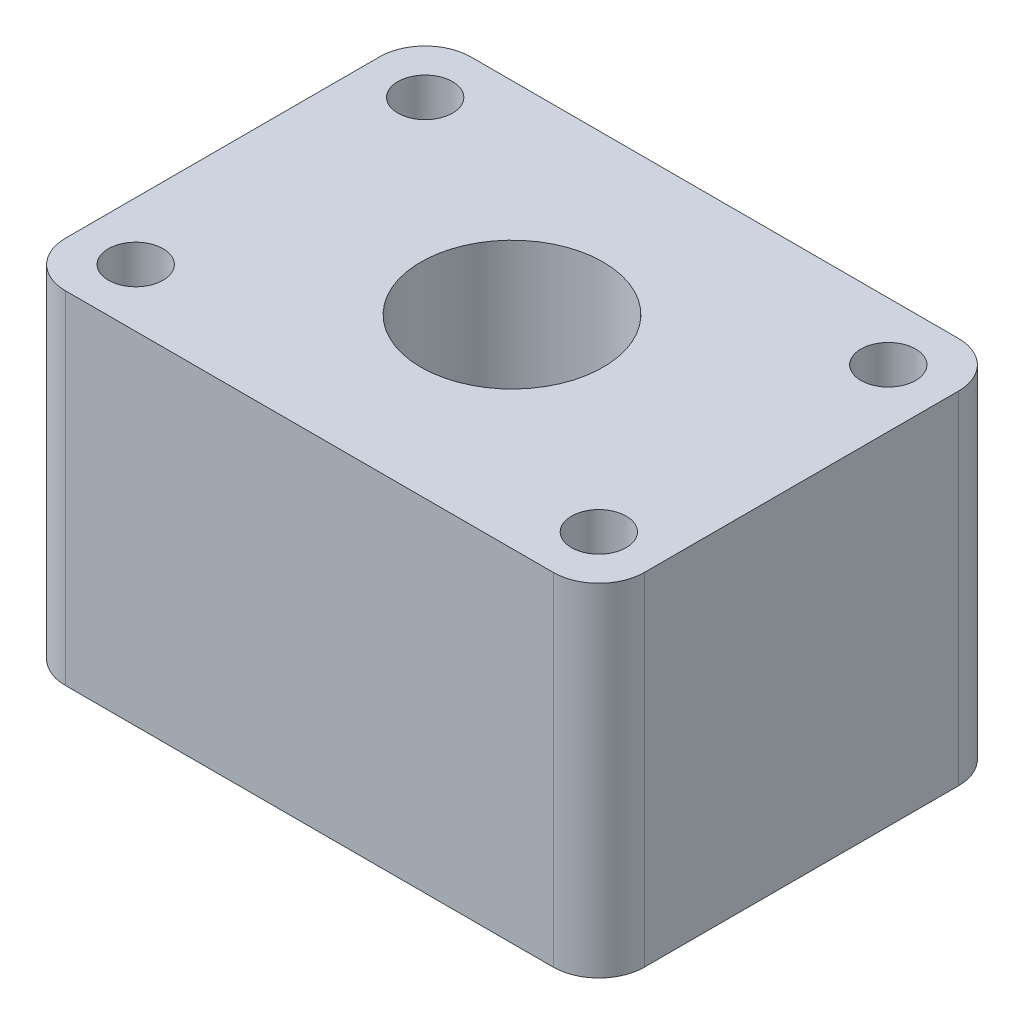
ISO-10303-21;
HEADER;
FILE_DESCRIPTION(('STEP AP214'),'2;1');
FILE_NAME('part.step','',(''),(''),'','','');
FILE_SCHEMA(('AUTOMOTIVE_DESIGN { 1 0 10303 214 1 1 1 1 }'));
ENDSEC;
DATA;
#1=APPLICATION_CONTEXT('core data for automotive mechanical design processes');
#2=APPLICATION_PROTOCOL_DEFINITION('international standard','automotive_design',2000,#1);
#3=PRODUCT_CONTEXT('',#1,'mechanical');
#4=PRODUCT('Part','Part','',(#3));
#5=PRODUCT_RELATED_PRODUCT_CATEGORY('part','',(#4));
#6=PRODUCT_DEFINITION_FORMATION('','',#4);
#7=PRODUCT_DEFINITION_CONTEXT('part definition',#1,'design');
#8=PRODUCT_DEFINITION('design','',#6,#7);
#9=PRODUCT_DEFINITION_SHAPE('','',#8);
#10=(LENGTH_UNIT() NAMED_UNIT(*) SI_UNIT(.MILLI.,.METRE.));
#11=(NAMED_UNIT(*) PLANE_ANGLE_UNIT() SI_UNIT($,.RADIAN.));
#12=(NAMED_UNIT(*) SI_UNIT($,.STERADIAN.) SOLID_ANGLE_UNIT());
#13=UNCERTAINTY_MEASURE_WITH_UNIT(LENGTH_MEASURE(1.E-05),#10,'distance_accuracy_value','');
#14=(GEOMETRIC_REPRESENTATION_CONTEXT(3) GLOBAL_UNCERTAINTY_ASSIGNED_CONTEXT((#13)) GLOBAL_UNIT_ASSIGNED_CONTEXT((#10,
#11,#12)) REPRESENTATION_CONTEXT('',''));
#15=CARTESIAN_POINT('',(0.,0.,0.));
#16=DIRECTION('',(0.,0.,1.));
#17=DIRECTION('',(1.,0.,0.));
#18=AXIS2_PLACEMENT_3D('',#15,#16,#17);
#19=CARTESIAN_POINT('',(0.,0.,0.));
#20=DIRECTION('',(0.,1.,0.));
#21=DIRECTION('',(0.,0.,1.));
#22=AXIS2_PLACEMENT_3D('',#19,#20,#21);
#23=PLANE('',#22);
#24=DIRECTION('',(1.,0.,0.));
#25=VECTOR('',#24,1.);
#26=CARTESIAN_POINT('',(-12.7,0.,8.89));
#27=LINE('',#26,#25);
#28=CARTESIAN_POINT('',(-10.7,0.,8.89));
#29=VERTEX_POINT('',#28);
#30=CARTESIAN_POINT('',(10.7,0.,8.89));
#31=VERTEX_POINT('',#30);
#32=EDGE_CURVE('E249',#29,#31,#27,.T.);
#33=ORIENTED_EDGE('',*,*,#32,.F.);
#34=CARTESIAN_POINT('',(-10.7,0.,6.89));
#35=DIRECTION('',(0.,1.,0.));
#36=DIRECTION('',(0.,0.,1.));
#37=AXIS2_PLACEMENT_3D('',#34,#35,#36);
#38=CIRCLE('',#37,2.);
#39=CARTESIAN_POINT('',(-12.7,0.,6.89));
#40=VERTEX_POINT('',#39);
#41=EDGE_CURVE('E269',#29,#40,#38,.F.);
#42=ORIENTED_EDGE('',*,*,#41,.T.);
#43=DIRECTION('',(0.,0.,1.));
#44=VECTOR('',#43,1.);
#45=CARTESIAN_POINT('',(-12.7,0.,-8.89));
#46=LINE('',#45,#44);
#47=CARTESIAN_POINT('',(-12.7,0.,-6.89));
#48=VERTEX_POINT('',#47);
#49=EDGE_CURVE('E226',#48,#40,#46,.T.);
#50=ORIENTED_EDGE('',*,*,#49,.F.);
#51=CARTESIAN_POINT('',(-10.7,0.,-6.89));
#52=DIRECTION('',(0.,1.,0.));
#53=DIRECTION('',(0.,0.,1.));
#54=AXIS2_PLACEMENT_3D('',#51,#52,#53);
#55=CIRCLE('',#54,2.);
#56=CARTESIAN_POINT('',(-10.7,0.,-8.89));
#57=VERTEX_POINT('',#56);
#58=EDGE_CURVE('E263',#48,#57,#55,.F.);
#59=ORIENTED_EDGE('',*,*,#58,.T.);
#60=DIRECTION('',(1.,0.,0.));
#61=VECTOR('',#60,1.);
#62=CARTESIAN_POINT('',(-12.7,0.,-8.89));
#63=LINE('',#62,#61);
#64=CARTESIAN_POINT('',(10.7,0.,-8.89));
#65=VERTEX_POINT('',#64);
#66=EDGE_CURVE('E237',#57,#65,#63,.T.);
#67=ORIENTED_EDGE('',*,*,#66,.T.);
#68=CARTESIAN_POINT('',(10.7,0.,-6.89));
#69=DIRECTION('',(0.,1.,0.));
#70=DIRECTION('',(0.,0.,1.));
#71=AXIS2_PLACEMENT_3D('',#68,#69,#70);
#72=CIRCLE('',#71,2.);
#73=CARTESIAN_POINT('',(12.7,0.,-6.89));
#74=VERTEX_POINT('',#73);
#75=EDGE_CURVE('E265',#65,#74,#72,.F.);
#76=ORIENTED_EDGE('',*,*,#75,.T.);
#77=DIRECTION('',(0.,0.,1.));
#78=VECTOR('',#77,1.);
#79=CARTESIAN_POINT('',(12.7,0.,-8.89));
#80=LINE('',#79,#78);
#81=CARTESIAN_POINT('',(12.7,0.,6.89));
#82=VERTEX_POINT('',#81);
#83=EDGE_CURVE('E252',#74,#82,#80,.T.);
#84=ORIENTED_EDGE('',*,*,#83,.T.);
#85=CARTESIAN_POINT('',(10.7,0.,6.89));
#86=DIRECTION('',(0.,1.,0.));
#87=DIRECTION('',(0.,0.,1.));
#88=AXIS2_PLACEMENT_3D('',#85,#86,#87);
#89=CIRCLE('',#88,2.);
#90=EDGE_CURVE('E267',#82,#31,#89,.F.);
#91=ORIENTED_EDGE('',*,*,#90,.T.);
#92=EDGE_LOOP('',(#33,#42,#50,#59,#67,#76,#84,#91));
#93=FACE_BOUND('',#92,.T.);
#94=CARTESIAN_POINT('',(-10.16,0.,6.35));
#95=DIRECTION('',(0.,1.,0.));
#96=DIRECTION('',(0.,0.,1.));
#97=AXIS2_PLACEMENT_3D('',#94,#95,#96);
#98=CIRCLE('',#97,1.7);
#99=CARTESIAN_POINT('',(-10.16,0.,8.05));
#100=VERTEX_POINT('',#99);
#101=EDGE_CURVE('E297',#100,#100,#98,.T.);
#102=ORIENTED_EDGE('',*,*,#101,.T.);
#103=EDGE_LOOP('',(#102));
#104=FACE_BOUND('',#103,.T.);
#105=CARTESIAN_POINT('',(10.16,0.,6.35));
#106=DIRECTION('',(0.,1.,0.));
#107=DIRECTION('',(0.,0.,1.));
#108=AXIS2_PLACEMENT_3D('',#105,#106,#107);
#109=CIRCLE('',#108,1.7);
#110=CARTESIAN_POINT('',(10.16,0.,8.05));
#111=VERTEX_POINT('',#110);
#112=EDGE_CURVE('E300',#111,#111,#109,.T.);
#113=ORIENTED_EDGE('',*,*,#112,.T.);
#114=EDGE_LOOP('',(#113));
#115=FACE_BOUND('',#114,.T.);
#116=CARTESIAN_POINT('',(10.16,0.,-6.35));
#117=DIRECTION('',(0.,1.,0.));
#118=DIRECTION('',(0.,0.,1.));
#119=AXIS2_PLACEMENT_3D('',#116,#117,#118);
#120=CIRCLE('',#119,1.70000000000001);
#121=CARTESIAN_POINT('',(10.16,0.,-4.64999999999999));
#122=VERTEX_POINT('',#121);
#123=EDGE_CURVE('E303',#122,#122,#120,.T.);
#124=ORIENTED_EDGE('',*,*,#123,.T.);
#125=EDGE_LOOP('',(#124));
#126=FACE_BOUND('',#125,.T.);
#127=CARTESIAN_POINT('',(-10.16,0.,-6.35));
#128=DIRECTION('',(0.,1.,0.));
#129=DIRECTION('',(0.,0.,1.));
#130=AXIS2_PLACEMENT_3D('',#127,#128,#129);
#131=CIRCLE('',#130,1.70000000000001);
#132=CARTESIAN_POINT('',(-10.16,0.,-4.64999999999999));
#133=VERTEX_POINT('',#132);
#134=EDGE_CURVE('E306',#133,#133,#131,.T.);
#135=ORIENTED_EDGE('',*,*,#134,.T.);
#136=EDGE_LOOP('',(#135));
#137=FACE_BOUND('',#136,.T.);
#138=DIRECTION('',(1.,0.,0.));
#139=VECTOR('',#138,1.);
#140=CARTESIAN_POINT('',(0.,0.,5.00000000000001));
#141=LINE('',#140,#139);
#142=CARTESIAN_POINT('',(-7.50000000000001,0.,5.00000000000001));
#143=VERTEX_POINT('',#142);
#144=CARTESIAN_POINT('',(7.50000000000001,0.,5.00000000000001));
#145=VERTEX_POINT('',#144);
#146=EDGE_CURVE('E313',#143,#145,#141,.T.);
#147=ORIENTED_EDGE('',*,*,#146,.T.);
#148=DIRECTION('',(0.,0.,-1.));
#149=VECTOR('',#148,1.);
#150=CARTESIAN_POINT('',(7.50000000000001,0.,0.));
#151=LINE('',#150,#149);
#152=CARTESIAN_POINT('',(7.50000000000001,0.,-5.00000000000001));
#153=VERTEX_POINT('',#152);
#154=EDGE_CURVE('E315',#145,#153,#151,.T.);
#155=ORIENTED_EDGE('',*,*,#154,.T.);
#156=DIRECTION('',(-1.,0.,0.));
#157=VECTOR('',#156,1.);
#158=CARTESIAN_POINT('',(0.,0.,-5.00000000000001));
#159=LINE('',#158,#157);
#160=CARTESIAN_POINT('',(-7.50000000000001,0.,-5.00000000000001));
#161=VERTEX_POINT('',#160);
#162=EDGE_CURVE('E309',#153,#161,#159,.T.);
#163=ORIENTED_EDGE('',*,*,#162,.T.);
#164=DIRECTION('',(0.,0.,1.));
#165=VECTOR('',#164,1.);
#166=CARTESIAN_POINT('',(-7.50000000000001,0.,0.));
#167=LINE('',#166,#165);
#168=EDGE_CURVE('E311',#161,#143,#167,.T.);
#169=ORIENTED_EDGE('',*,*,#168,.T.);
#170=EDGE_LOOP('',(#147,#155,#163,#169));
#171=FACE_BOUND('',#170,.T.);
#172=DIRECTION('',(0.,0.,-1.));
#173=VECTOR('',#172,1.);
#174=CARTESIAN_POINT('',(-8.,0.,0.));
#175=LINE('',#174,#173);
#176=CARTESIAN_POINT('',(-8.,0.,-5.39));
#177=VERTEX_POINT('',#176);
#178=CARTESIAN_POINT('',(-8.,0.,-7.39));
#179=VERTEX_POINT('',#178);
#180=EDGE_CURVE('E11',#177,#179,#175,.T.);
#181=ORIENTED_EDGE('',*,*,#180,.F.);
#182=DIRECTION('',(-1.,0.,0.));
#183=VECTOR('',#182,1.);
#184=CARTESIAN_POINT('',(0.,0.,-5.38999999999999));
#185=LINE('',#184,#183);
#186=CARTESIAN_POINT('',(8.,0.,-5.38999999999999));
#187=VERTEX_POINT('',#186);
#188=EDGE_CURVE('E335',#187,#177,#185,.T.);
#189=ORIENTED_EDGE('',*,*,#188,.F.);
#190=DIRECTION('',(0.,0.,1.));
#191=VECTOR('',#190,1.);
#192=CARTESIAN_POINT('',(8.,0.,0.));
#193=LINE('',#192,#191);
#194=CARTESIAN_POINT('',(8.,0.,-7.38999999999999));
#195=VERTEX_POINT('',#194);
#196=EDGE_CURVE('E345',#195,#187,#193,.T.);
#197=ORIENTED_EDGE('',*,*,#196,.F.);
#198=DIRECTION('',(1.,0.,0.));
#199=VECTOR('',#198,1.);
#200=CARTESIAN_POINT('',(0.,0.,-7.38999999999999));
#201=LINE('',#200,#199);
#202=EDGE_CURVE('E44',#179,#195,#201,.T.);
#203=ORIENTED_EDGE('',*,*,#202,.F.);
#204=EDGE_LOOP('',(#181,#189,#197,#203));
#205=FACE_BOUND('',#204,.T.);
#206=ADVANCED_FACE('F35',(#93,#104,#115,#126,#137,#171,#205),#23,.F.);
#207=CARTESIAN_POINT('',(-12.7,15.,-8.89));
#208=DIRECTION('',(1.,0.,0.));
#209=DIRECTION('',(0.,0.,-1.));
#210=AXIS2_PLACEMENT_3D('',#207,#208,#209);
#211=PLANE('',#210);
#212=ORIENTED_EDGE('',*,*,#49,.T.);
#213=DIRECTION('',(0.,-1.,0.));
#214=VECTOR('',#213,1.);
#215=CARTESIAN_POINT('',(-12.7,15.,6.89));
#216=LINE('',#215,#214);
#217=CARTESIAN_POINT('',(-12.7,15.,6.89));
#218=VERTEX_POINT('',#217);
#219=EDGE_CURVE('E274',#40,#218,#216,.F.);
#220=ORIENTED_EDGE('',*,*,#219,.T.);
#221=DIRECTION('',(0.,0.,1.));
#222=VECTOR('',#221,1.);
#223=CARTESIAN_POINT('',(-12.7,15.,-8.89));
#224=LINE('',#223,#222);
#225=CARTESIAN_POINT('',(-12.7,15.,-6.89));
#226=VERTEX_POINT('',#225);
#227=EDGE_CURVE('E233',#226,#218,#224,.T.);
#228=ORIENTED_EDGE('',*,*,#227,.F.);
#229=DIRECTION('',(0.,-1.,0.));
#230=VECTOR('',#229,1.);
#231=CARTESIAN_POINT('',(-12.7,0.,-6.89));
#232=LINE('',#231,#230);
#233=EDGE_CURVE('E271',#226,#48,#232,.T.);
#234=ORIENTED_EDGE('',*,*,#233,.T.);
#235=EDGE_LOOP('',(#212,#220,#228,#234));
#236=FACE_BOUND('',#235,.T.);
#237=ADVANCED_FACE('F361',(#236),#211,.F.);
#238=CARTESIAN_POINT('',(-12.7,15.,8.89));
#239=DIRECTION('',(0.,0.,-1.));
#240=DIRECTION('',(-1.,0.,0.));
#241=AXIS2_PLACEMENT_3D('',#238,#239,#240);
#242=PLANE('',#241);
#243=DIRECTION('',(1.,0.,0.));
#244=VECTOR('',#243,1.);
#245=CARTESIAN_POINT('',(-12.7,15.,8.89));
#246=LINE('',#245,#244);
#247=CARTESIAN_POINT('',(-10.7,15.,8.89));
#248=VERTEX_POINT('',#247);
#249=CARTESIAN_POINT('',(10.7,15.,8.89));
#250=VERTEX_POINT('',#249);
#251=EDGE_CURVE('E236',#248,#250,#246,.T.);
#252=ORIENTED_EDGE('',*,*,#251,.F.);
#253=DIRECTION('',(0.,-1.,0.));
#254=VECTOR('',#253,1.);
#255=CARTESIAN_POINT('',(-10.7,15.,8.89));
#256=LINE('',#255,#254);
#257=EDGE_CURVE('E260',#248,#29,#256,.T.);
#258=ORIENTED_EDGE('',*,*,#257,.T.);
#259=ORIENTED_EDGE('',*,*,#32,.T.);
#260=DIRECTION('',(0.,-1.,0.));
#261=VECTOR('',#260,1.);
#262=CARTESIAN_POINT('',(10.7,15.,8.89));
#263=LINE('',#262,#261);
#264=EDGE_CURVE('E246',#31,#250,#263,.F.);
#265=ORIENTED_EDGE('',*,*,#264,.T.);
#266=EDGE_LOOP('',(#252,#258,#259,#265));
#267=FACE_BOUND('',#266,.T.);
#268=ADVANCED_FACE('F369',(#267),#242,.F.);
#269=CARTESIAN_POINT('',(12.7,15.,-8.89));
#270=DIRECTION('',(1.,0.,0.));
#271=DIRECTION('',(0.,0.,-1.));
#272=AXIS2_PLACEMENT_3D('',#269,#270,#271);
#273=PLANE('',#272);
#274=DIRECTION('',(0.,0.,1.));
#275=VECTOR('',#274,1.);
#276=CARTESIAN_POINT('',(12.7,15.,-8.89));
#277=LINE('',#276,#275);
#278=CARTESIAN_POINT('',(12.7,15.,-6.89));
#279=VERTEX_POINT('',#278);
#280=CARTESIAN_POINT('',(12.7,15.,6.89));
#281=VERTEX_POINT('',#280);
#282=EDGE_CURVE('E240',#279,#281,#277,.T.);
#283=ORIENTED_EDGE('',*,*,#282,.T.);
#284=DIRECTION('',(0.,-1.,0.));
#285=VECTOR('',#284,1.);
#286=CARTESIAN_POINT('',(12.7,0.,6.89));
#287=LINE('',#286,#285);
#288=EDGE_CURVE('E286',#281,#82,#287,.T.);
#289=ORIENTED_EDGE('',*,*,#288,.T.);
#290=ORIENTED_EDGE('',*,*,#83,.F.);
#291=DIRECTION('',(0.,-1.,0.));
#292=VECTOR('',#291,1.);
#293=CARTESIAN_POINT('',(12.7,15.,-6.89));
#294=LINE('',#293,#292);
#295=EDGE_CURVE('E284',#74,#279,#294,.F.);
#296=ORIENTED_EDGE('',*,*,#295,.T.);
#297=EDGE_LOOP('',(#283,#289,#290,#296));
#298=FACE_BOUND('',#297,.T.);
#299=ADVANCED_FACE('F381',(#298),#273,.T.);
#300=CARTESIAN_POINT('',(-12.7,15.,-8.89));
#301=DIRECTION('',(0.,0.,-1.));
#302=DIRECTION('',(-1.,0.,0.));
#303=AXIS2_PLACEMENT_3D('',#300,#301,#302);
#304=PLANE('',#303);
#305=DIRECTION('',(1.,0.,0.));
#306=VECTOR('',#305,1.);
#307=CARTESIAN_POINT('',(-12.7,15.,-8.89));
#308=LINE('',#307,#306);
#309=CARTESIAN_POINT('',(-10.7,15.,-8.89));
#310=VERTEX_POINT('',#309);
#311=CARTESIAN_POINT('',(10.7,15.,-8.89));
#312=VERTEX_POINT('',#311);
#313=EDGE_CURVE('E243',#310,#312,#308,.T.);
#314=ORIENTED_EDGE('',*,*,#313,.T.);
#315=DIRECTION('',(0.,-1.,0.));
#316=VECTOR('',#315,1.);
#317=CARTESIAN_POINT('',(10.7,15.,-8.89));
#318=LINE('',#317,#316);
#319=EDGE_CURVE('E291',#312,#65,#318,.T.);
#320=ORIENTED_EDGE('',*,*,#319,.T.);
#321=ORIENTED_EDGE('',*,*,#66,.F.);
#322=DIRECTION('',(0.,-1.,0.));
#323=VECTOR('',#322,1.);
#324=CARTESIAN_POINT('',(-10.7,15.,-8.89));
#325=LINE('',#324,#323);
#326=EDGE_CURVE('E289',#57,#310,#325,.F.);
#327=ORIENTED_EDGE('',*,*,#326,.T.);
#328=EDGE_LOOP('',(#314,#320,#321,#327));
#329=FACE_BOUND('',#328,.T.);
#330=ADVANCED_FACE('F378',(#329),#304,.T.);
#331=CARTESIAN_POINT('',(0.,15.,0.));
#332=DIRECTION('',(0.,1.,0.));
#333=DIRECTION('',(0.,0.,1.));
#334=AXIS2_PLACEMENT_3D('',#331,#332,#333);
#335=PLANE('',#334);
#336=CARTESIAN_POINT('',(10.16,15.,-6.35));
#337=DIRECTION('',(0.,1.,0.));
#338=DIRECTION('',(0.,0.,1.));
#339=AXIS2_PLACEMENT_3D('',#336,#337,#338);
#340=CIRCLE('',#339,1.2);
#341=CARTESIAN_POINT('',(10.16,15.,-5.15));
#342=VERTEX_POINT('',#341);
#343=EDGE_CURVE('E203',#342,#342,#340,.T.);
#344=ORIENTED_EDGE('',*,*,#343,.F.);
#345=EDGE_LOOP('',(#344));
#346=FACE_BOUND('',#345,.T.);
#347=CARTESIAN_POINT('',(10.16,15.,6.35));
#348=DIRECTION('',(0.,1.,0.));
#349=DIRECTION('',(0.,0.,1.));
#350=AXIS2_PLACEMENT_3D('',#347,#348,#349);
#351=CIRCLE('',#350,1.2);
#352=CARTESIAN_POINT('',(10.16,15.,7.55));
#353=VERTEX_POINT('',#352);
#354=EDGE_CURVE('E200',#353,#353,#351,.T.);
#355=ORIENTED_EDGE('',*,*,#354,.F.);
#356=EDGE_LOOP('',(#355));
#357=FACE_BOUND('',#356,.T.);
#358=CARTESIAN_POINT('',(-10.16,15.,6.35));
#359=DIRECTION('',(0.,1.,0.));
#360=DIRECTION('',(0.,0.,1.));
#361=AXIS2_PLACEMENT_3D('',#358,#359,#360);
#362=CIRCLE('',#361,1.2);
#363=CARTESIAN_POINT('',(-10.16,15.,7.55));
#364=VERTEX_POINT('',#363);
#365=EDGE_CURVE('E196',#364,#364,#362,.T.);
#366=ORIENTED_EDGE('',*,*,#365,.F.);
#367=EDGE_LOOP('',(#366));
#368=FACE_BOUND('',#367,.T.);
#369=CARTESIAN_POINT('',(-10.16,15.,-6.35));
#370=DIRECTION('',(0.,1.,0.));
#371=DIRECTION('',(0.,0.,1.));
#372=AXIS2_PLACEMENT_3D('',#369,#370,#371);
#373=CIRCLE('',#372,1.2);
#374=CARTESIAN_POINT('',(-10.16,15.,-5.15));
#375=VERTEX_POINT('',#374);
#376=EDGE_CURVE('E193',#375,#375,#373,.T.);
#377=ORIENTED_EDGE('',*,*,#376,.F.);
#378=EDGE_LOOP('',(#377));
#379=FACE_BOUND('',#378,.T.);
#380=CARTESIAN_POINT('',(0.,15.,0.));
#381=DIRECTION('',(0.,1.,0.));
#382=DIRECTION('',(0.,0.,1.));
#383=AXIS2_PLACEMENT_3D('',#380,#381,#382);
#384=CIRCLE('',#383,4.);
#385=CARTESIAN_POINT('',(0.,15.,4.));
#386=VERTEX_POINT('',#385);
#387=EDGE_CURVE('E206',#386,#386,#384,.T.);
#388=ORIENTED_EDGE('',*,*,#387,.F.);
#389=EDGE_LOOP('',(#388));
#390=FACE_BOUND('',#389,.T.);
#391=ORIENTED_EDGE('',*,*,#227,.T.);
#392=CARTESIAN_POINT('',(-10.7,15.,6.89));
#393=DIRECTION('',(0.,1.,0.));
#394=DIRECTION('',(0.,0.,1.));
#395=AXIS2_PLACEMENT_3D('',#392,#393,#394);
#396=CIRCLE('',#395,2.);
#397=EDGE_CURVE('E282',#218,#248,#396,.T.);
#398=ORIENTED_EDGE('',*,*,#397,.T.);
#399=ORIENTED_EDGE('',*,*,#251,.T.);
#400=CARTESIAN_POINT('',(10.7,15.,6.89));
#401=DIRECTION('',(0.,1.,0.));
#402=DIRECTION('',(0.,0.,1.));
#403=AXIS2_PLACEMENT_3D('',#400,#401,#402);
#404=CIRCLE('',#403,2.);
#405=EDGE_CURVE('E280',#250,#281,#404,.T.);
#406=ORIENTED_EDGE('',*,*,#405,.T.);
#407=ORIENTED_EDGE('',*,*,#282,.F.);
#408=CARTESIAN_POINT('',(10.7,15.,-6.89));
#409=DIRECTION('',(0.,1.,0.));
#410=DIRECTION('',(0.,0.,1.));
#411=AXIS2_PLACEMENT_3D('',#408,#409,#410);
#412=CIRCLE('',#411,2.);
#413=EDGE_CURVE('E278',#279,#312,#412,.T.);
#414=ORIENTED_EDGE('',*,*,#413,.T.);
#415=ORIENTED_EDGE('',*,*,#313,.F.);
#416=CARTESIAN_POINT('',(-10.7,15.,-6.89));
#417=DIRECTION('',(0.,1.,0.));
#418=DIRECTION('',(0.,0.,1.));
#419=AXIS2_PLACEMENT_3D('',#416,#417,#418);
#420=CIRCLE('',#419,2.);
#421=EDGE_CURVE('E276',#310,#226,#420,.T.);
#422=ORIENTED_EDGE('',*,*,#421,.T.);
#423=EDGE_LOOP('',(#391,#398,#399,#406,#407,#414,#415,#422));
#424=FACE_BOUND('',#423,.T.);
#425=ADVANCED_FACE('F376',(#346,#357,#368,#379,#390,#424),#335,.T.);
#426=CARTESIAN_POINT('',(7.,4.,4.5));
#427=DIRECTION('',(1.,0.,0.));
#428=DIRECTION('',(0.,0.,-1.));
#429=AXIS2_PLACEMENT_3D('',#426,#427,#428);
#430=PLANE('',#429);
#431=DIRECTION('',(0.,-1.,0.));
#432=VECTOR('',#431,1.);
#433=CARTESIAN_POINT('',(7.,4.,-4.5));
#434=LINE('',#433,#432);
#435=CARTESIAN_POINT('',(7.,4.,-4.5));
#436=VERTEX_POINT('',#435);
#437=CARTESIAN_POINT('',(7.,0.500000000000007,-4.5));
#438=VERTEX_POINT('',#437);
#439=EDGE_CURVE('E223',#436,#438,#434,.T.);
#440=ORIENTED_EDGE('',*,*,#439,.T.);
#441=DIRECTION('',(0.,0.,1.));
#442=VECTOR('',#441,1.);
#443=CARTESIAN_POINT('',(7.,0.500000000000007,4.5));
#444=LINE('',#443,#442);
#445=CARTESIAN_POINT('',(7.,0.500000000000007,4.5));
#446=VERTEX_POINT('',#445);
#447=EDGE_CURVE('E294',#438,#446,#444,.T.);
#448=ORIENTED_EDGE('',*,*,#447,.T.);
#449=DIRECTION('',(0.,-1.,0.));
#450=VECTOR('',#449,1.);
#451=CARTESIAN_POINT('',(7.,4.,4.5));
#452=LINE('',#451,#450);
#453=CARTESIAN_POINT('',(7.,4.,4.5));
#454=VERTEX_POINT('',#453);
#455=EDGE_CURVE('E222',#454,#446,#452,.T.);
#456=ORIENTED_EDGE('',*,*,#455,.F.);
#457=DIRECTION('',(0.,0.,1.));
#458=VECTOR('',#457,1.);
#459=CARTESIAN_POINT('',(7.,4.,4.5));
#460=LINE('',#459,#458);
#461=EDGE_CURVE('E210',#436,#454,#460,.T.);
#462=ORIENTED_EDGE('',*,*,#461,.F.);
#463=EDGE_LOOP('',(#440,#448,#456,#462));
#464=FACE_BOUND('',#463,.T.);
#465=ADVANCED_FACE('F470',(#464),#430,.F.);
#466=CARTESIAN_POINT('',(-7.,4.,-4.5));
#467=DIRECTION('',(0.,0.,-1.));
#468=DIRECTION('',(-1.,0.,0.));
#469=AXIS2_PLACEMENT_3D('',#466,#467,#468);
#470=PLANE('',#469);
#471=DIRECTION('',(0.,-1.,0.));
#472=VECTOR('',#471,1.);
#473=CARTESIAN_POINT('',(-7.,4.,-4.5));
#474=LINE('',#473,#472);
#475=CARTESIAN_POINT('',(-7.,4.,-4.5));
#476=VERTEX_POINT('',#475);
#477=CARTESIAN_POINT('',(-7.,0.500000000000007,-4.5));
#478=VERTEX_POINT('',#477);
#479=EDGE_CURVE('E227',#476,#478,#474,.T.);
#480=ORIENTED_EDGE('',*,*,#479,.T.);
#481=DIRECTION('',(1.,0.,0.));
#482=VECTOR('',#481,1.);
#483=CARTESIAN_POINT('',(-7.,0.500000000000007,-4.5));
#484=LINE('',#483,#482);
#485=EDGE_CURVE('E321',#478,#438,#484,.T.);
#486=ORIENTED_EDGE('',*,*,#485,.T.);
#487=ORIENTED_EDGE('',*,*,#439,.F.);
#488=DIRECTION('',(1.,0.,0.));
#489=VECTOR('',#488,1.);
#490=CARTESIAN_POINT('',(-7.,4.,-4.5));
#491=LINE('',#490,#489);
#492=EDGE_CURVE('E219',#476,#436,#491,.T.);
#493=ORIENTED_EDGE('',*,*,#492,.F.);
#494=EDGE_LOOP('',(#480,#486,#487,#493));
#495=FACE_BOUND('',#494,.T.);
#496=ADVANCED_FACE('F515',(#495),#470,.F.);
#497=CARTESIAN_POINT('',(-7.,4.,4.5));
#498=DIRECTION('',(-1.,0.,0.));
#499=DIRECTION('',(0.,0.,1.));
#500=AXIS2_PLACEMENT_3D('',#497,#498,#499);
#501=PLANE('',#500);
#502=DIRECTION('',(0.,-1.,0.));
#503=VECTOR('',#502,1.);
#504=CARTESIAN_POINT('',(-7.,4.,4.5));
#505=LINE('',#504,#503);
#506=CARTESIAN_POINT('',(-7.,4.,4.5));
#507=VERTEX_POINT('',#506);
#508=CARTESIAN_POINT('',(-7.,0.500000000000007,4.5));
#509=VERTEX_POINT('',#508);
#510=EDGE_CURVE('E229',#507,#509,#505,.T.);
#511=ORIENTED_EDGE('',*,*,#510,.T.);
#512=DIRECTION('',(0.,0.,-1.));
#513=VECTOR('',#512,1.);
#514=CARTESIAN_POINT('',(-7.,0.500000000000007,4.5));
#515=LINE('',#514,#513);
#516=EDGE_CURVE('E59',#509,#478,#515,.T.);
#517=ORIENTED_EDGE('',*,*,#516,.T.);
#518=ORIENTED_EDGE('',*,*,#479,.F.);
#519=DIRECTION('',(0.,0.,-1.));
#520=VECTOR('',#519,1.);
#521=CARTESIAN_POINT('',(-7.,4.,4.5));
#522=LINE('',#521,#520);
#523=EDGE_CURVE('E216',#507,#476,#522,.T.);
#524=ORIENTED_EDGE('',*,*,#523,.F.);
#525=EDGE_LOOP('',(#511,#517,#518,#524));
#526=FACE_BOUND('',#525,.T.);
#527=ADVANCED_FACE('F518',(#526),#501,.F.);
#528=CARTESIAN_POINT('',(-7.,4.,4.5));
#529=DIRECTION('',(0.,0.,1.));
#530=DIRECTION('',(1.,0.,0.));
#531=AXIS2_PLACEMENT_3D('',#528,#529,#530);
#532=PLANE('',#531);
#533=ORIENTED_EDGE('',*,*,#455,.T.);
#534=DIRECTION('',(-1.,0.,0.));
#535=VECTOR('',#534,1.);
#536=CARTESIAN_POINT('',(-7.,0.500000000000007,4.5));
#537=LINE('',#536,#535);
#538=EDGE_CURVE('E318',#446,#509,#537,.T.);
#539=ORIENTED_EDGE('',*,*,#538,.T.);
#540=ORIENTED_EDGE('',*,*,#510,.F.);
#541=DIRECTION('',(-1.,0.,0.));
#542=VECTOR('',#541,1.);
#543=CARTESIAN_POINT('',(-7.,4.,4.5));
#544=LINE('',#543,#542);
#545=EDGE_CURVE('E213',#454,#507,#544,.T.);
#546=ORIENTED_EDGE('',*,*,#545,.F.);
#547=EDGE_LOOP('',(#533,#539,#540,#546));
#548=FACE_BOUND('',#547,.T.);
#549=ADVANCED_FACE('F510',(#548),#532,.F.);
#550=CARTESIAN_POINT('',(0.,4.,0.));
#551=DIRECTION('',(0.,-1.,0.));
#552=DIRECTION('',(0.,0.,-1.));
#553=AXIS2_PLACEMENT_3D('',#550,#551,#552);
#554=PLANE('',#553);
#555=CARTESIAN_POINT('',(0.,4.,0.));
#556=DIRECTION('',(0.,-1.,0.));
#557=DIRECTION('',(0.,0.,-1.));
#558=AXIS2_PLACEMENT_3D('',#555,#556,#557);
#559=CIRCLE('',#558,4.);
#560=CARTESIAN_POINT('',(0.,4.,-4.));
#561=VERTEX_POINT('',#560);
#562=EDGE_CURVE('E209',#561,#561,#559,.T.);
#563=ORIENTED_EDGE('',*,*,#562,.F.);
#564=EDGE_LOOP('',(#563));
#565=FACE_BOUND('',#564,.T.);
#566=ORIENTED_EDGE('',*,*,#461,.T.);
#567=ORIENTED_EDGE('',*,*,#545,.T.);
#568=ORIENTED_EDGE('',*,*,#523,.T.);
#569=ORIENTED_EDGE('',*,*,#492,.T.);
#570=EDGE_LOOP('',(#566,#567,#568,#569));
#571=FACE_BOUND('',#570,.T.);
#572=ADVANCED_FACE('F501',(#565,#571),#554,.T.);
#573=CARTESIAN_POINT('',(0.,-10.,0.));
#574=DIRECTION('',(0.,1.,0.));
#575=DIRECTION('',(0.,0.,1.));
#576=AXIS2_PLACEMENT_3D('',#573,#574,#575);
#577=CYLINDRICAL_SURFACE('',#576,4.);
#578=ORIENTED_EDGE('',*,*,#562,.T.);
#579=EDGE_LOOP('',(#578));
#580=FACE_BOUND('',#579,.T.);
#581=ORIENTED_EDGE('',*,*,#387,.T.);
#582=EDGE_LOOP('',(#581));
#583=FACE_BOUND('',#582,.T.);
#584=ADVANCED_FACE('F498',(#580,#583),#577,.F.);
#585=CARTESIAN_POINT('',(-10.16,25.,-6.35));
#586=DIRECTION('',(0.,-1.,0.));
#587=DIRECTION('',(0.,0.,-1.));
#588=AXIS2_PLACEMENT_3D('',#585,#586,#587);
#589=CYLINDRICAL_SURFACE('',#588,1.2);
#590=CARTESIAN_POINT('',(-10.16,0.500000000000004,-6.35));
#591=DIRECTION('',(0.,1.,0.));
#592=DIRECTION('',(0.,0.,1.));
#593=AXIS2_PLACEMENT_3D('',#590,#591,#592);
#594=CIRCLE('',#593,1.2);
#595=CARTESIAN_POINT('',(-10.16,0.500000000000004,-5.15));
#596=VERTEX_POINT('',#595);
#597=EDGE_CURVE('E323',#596,#596,#594,.F.);
#598=ORIENTED_EDGE('',*,*,#597,.T.);
#599=EDGE_LOOP('',(#598));
#600=FACE_BOUND('',#599,.T.);
#601=ORIENTED_EDGE('',*,*,#376,.T.);
#602=EDGE_LOOP('',(#601));
#603=FACE_BOUND('',#602,.T.);
#604=ADVANCED_FACE('F500',(#600,#603),#589,.F.);
#605=CARTESIAN_POINT('',(-10.16,25.,6.35));
#606=DIRECTION('',(0.,-1.,0.));
#607=DIRECTION('',(0.,0.,-1.));
#608=AXIS2_PLACEMENT_3D('',#605,#606,#607);
#609=CYLINDRICAL_SURFACE('',#608,1.2);
#610=CARTESIAN_POINT('',(-10.16,0.499999999999994,6.35));
#611=DIRECTION('',(0.,1.,0.));
#612=DIRECTION('',(0.,0.,1.));
#613=AXIS2_PLACEMENT_3D('',#610,#611,#612);
#614=CIRCLE('',#613,1.2);
#615=CARTESIAN_POINT('',(-10.16,0.499999999999994,7.55));
#616=VERTEX_POINT('',#615);
#617=EDGE_CURVE('E332',#616,#616,#614,.F.);
#618=ORIENTED_EDGE('',*,*,#617,.T.);
#619=EDGE_LOOP('',(#618));
#620=FACE_BOUND('',#619,.T.);
#621=ORIENTED_EDGE('',*,*,#365,.T.);
#622=EDGE_LOOP('',(#621));
#623=FACE_BOUND('',#622,.T.);
#624=ADVANCED_FACE('F464',(#620,#623),#609,.F.);
#625=CARTESIAN_POINT('',(10.16,25.,6.35));
#626=DIRECTION('',(0.,-1.,0.));
#627=DIRECTION('',(0.,0.,-1.));
#628=AXIS2_PLACEMENT_3D('',#625,#626,#627);
#629=CYLINDRICAL_SURFACE('',#628,1.2);
#630=CARTESIAN_POINT('',(10.16,0.499999999999994,6.35));
#631=DIRECTION('',(0.,1.,0.));
#632=DIRECTION('',(0.,0.,1.));
#633=AXIS2_PLACEMENT_3D('',#630,#631,#632);
#634=CIRCLE('',#633,1.2);
#635=CARTESIAN_POINT('',(10.16,0.499999999999994,7.55));
#636=VERTEX_POINT('',#635);
#637=EDGE_CURVE('E329',#636,#636,#634,.F.);
#638=ORIENTED_EDGE('',*,*,#637,.T.);
#639=EDGE_LOOP('',(#638));
#640=FACE_BOUND('',#639,.T.);
#641=ORIENTED_EDGE('',*,*,#354,.T.);
#642=EDGE_LOOP('',(#641));
#643=FACE_BOUND('',#642,.T.);
#644=ADVANCED_FACE('F461',(#640,#643),#629,.F.);
#645=CARTESIAN_POINT('',(10.16,25.,-6.35));
#646=DIRECTION('',(0.,-1.,0.));
#647=DIRECTION('',(0.,0.,-1.));
#648=AXIS2_PLACEMENT_3D('',#645,#646,#647);
#649=CYLINDRICAL_SURFACE('',#648,1.2);
#650=CARTESIAN_POINT('',(10.16,0.500000000000004,-6.35));
#651=DIRECTION('',(0.,1.,0.));
#652=DIRECTION('',(0.,0.,1.));
#653=AXIS2_PLACEMENT_3D('',#650,#651,#652);
#654=CIRCLE('',#653,1.2);
#655=CARTESIAN_POINT('',(10.16,0.500000000000004,-5.15));
#656=VERTEX_POINT('',#655);
#657=EDGE_CURVE('E326',#656,#656,#654,.F.);
#658=ORIENTED_EDGE('',*,*,#657,.T.);
#659=EDGE_LOOP('',(#658));
#660=FACE_BOUND('',#659,.T.);
#661=ORIENTED_EDGE('',*,*,#343,.T.);
#662=EDGE_LOOP('',(#661));
#663=FACE_BOUND('',#662,.T.);
#664=ADVANCED_FACE('F393',(#660,#663),#649,.F.);
#665=CARTESIAN_POINT('',(-10.7,15.,6.89));
#666=DIRECTION('',(0.,-1.,0.));
#667=DIRECTION('',(0.,0.,-1.));
#668=AXIS2_PLACEMENT_3D('',#665,#666,#667);
#669=CYLINDRICAL_SURFACE('',#668,2.);
#670=ORIENTED_EDGE('',*,*,#397,.F.);
#671=ORIENTED_EDGE('',*,*,#219,.F.);
#672=ORIENTED_EDGE('',*,*,#41,.F.);
#673=ORIENTED_EDGE('',*,*,#257,.F.);
#674=EDGE_LOOP('',(#670,#671,#672,#673));
#675=FACE_BOUND('',#674,.T.);
#676=ADVANCED_FACE('F389',(#675),#669,.T.);
#677=CARTESIAN_POINT('',(10.7,15.,6.89));
#678=DIRECTION('',(0.,1.,0.));
#679=DIRECTION('',(0.,0.,1.));
#680=AXIS2_PLACEMENT_3D('',#677,#678,#679);
#681=CYLINDRICAL_SURFACE('',#680,2.);
#682=ORIENTED_EDGE('',*,*,#405,.F.);
#683=ORIENTED_EDGE('',*,*,#264,.F.);
#684=ORIENTED_EDGE('',*,*,#90,.F.);
#685=ORIENTED_EDGE('',*,*,#288,.F.);
#686=EDGE_LOOP('',(#682,#683,#684,#685));
#687=FACE_BOUND('',#686,.T.);
#688=ADVANCED_FACE('F392',(#687),#681,.T.);
#689=CARTESIAN_POINT('',(10.7,15.,-6.89));
#690=DIRECTION('',(0.,-1.,0.));
#691=DIRECTION('',(0.,0.,-1.));
#692=AXIS2_PLACEMENT_3D('',#689,#690,#691);
#693=CYLINDRICAL_SURFACE('',#692,2.);
#694=ORIENTED_EDGE('',*,*,#413,.F.);
#695=ORIENTED_EDGE('',*,*,#295,.F.);
#696=ORIENTED_EDGE('',*,*,#75,.F.);
#697=ORIENTED_EDGE('',*,*,#319,.F.);
#698=EDGE_LOOP('',(#694,#695,#696,#697));
#699=FACE_BOUND('',#698,.T.);
#700=ADVANCED_FACE('F397',(#699),#693,.T.);
#701=CARTESIAN_POINT('',(-10.7,15.,-6.89));
#702=DIRECTION('',(0.,1.,0.));
#703=DIRECTION('',(0.,0.,1.));
#704=AXIS2_PLACEMENT_3D('',#701,#702,#703);
#705=CYLINDRICAL_SURFACE('',#704,2.);
#706=ORIENTED_EDGE('',*,*,#421,.F.);
#707=ORIENTED_EDGE('',*,*,#326,.F.);
#708=ORIENTED_EDGE('',*,*,#58,.F.);
#709=ORIENTED_EDGE('',*,*,#233,.F.);
#710=EDGE_LOOP('',(#706,#707,#708,#709));
#711=FACE_BOUND('',#710,.T.);
#712=ADVANCED_FACE('F401',(#711),#705,.T.);
#713=CARTESIAN_POINT('',(-7.,0.500000000000007,4.5));
#714=DIRECTION('',(-0.707106781186548,0.707106781186547,0.));
#715=DIRECTION('',(0.,0.,-1.));
#716=AXIS2_PLACEMENT_3D('',#713,#714,#715);
#717=PLANE('',#716);
#718=DIRECTION('',(-0.577350269189625,-0.577350269189626,0.577350269189626));
#719=VECTOR('',#718,1.);
#720=CARTESIAN_POINT('',(-7.,0.500000000000007,4.5));
#721=LINE('',#720,#719);
#722=EDGE_CURVE('E339',#143,#509,#721,.F.);
#723=ORIENTED_EDGE('',*,*,#722,.F.);
#724=ORIENTED_EDGE('',*,*,#168,.F.);
#725=DIRECTION('',(-0.577350269189625,-0.577350269189626,-0.577350269189626));
#726=VECTOR('',#725,1.);
#727=CARTESIAN_POINT('',(-4.,3.50000000000001,-1.49999999999999));
#728=LINE('',#727,#726);
#729=EDGE_CURVE('E197',#478,#161,#728,.T.);
#730=ORIENTED_EDGE('',*,*,#729,.F.);
#731=ORIENTED_EDGE('',*,*,#516,.F.);
#732=EDGE_LOOP('',(#723,#724,#730,#731));
#733=FACE_BOUND('',#732,.T.);
#734=ADVANCED_FACE('F405',(#733),#717,.F.);
#735=CARTESIAN_POINT('',(-7.,0.500000000000007,-4.5));
#736=DIRECTION('',(0.,0.707106781186547,-0.707106781186547));
#737=DIRECTION('',(1.,0.,0.));
#738=AXIS2_PLACEMENT_3D('',#735,#736,#737);
#739=PLANE('',#738);
#740=ORIENTED_EDGE('',*,*,#729,.T.);
#741=ORIENTED_EDGE('',*,*,#162,.F.);
#742=DIRECTION('',(-0.577350269189626,0.577350269189626,0.577350269189626));
#743=VECTOR('',#742,1.);
#744=CARTESIAN_POINT('',(4.,3.50000000000001,-1.5));
#745=LINE('',#744,#743);
#746=EDGE_CURVE('E337',#438,#153,#745,.F.);
#747=ORIENTED_EDGE('',*,*,#746,.F.);
#748=ORIENTED_EDGE('',*,*,#485,.F.);
#749=EDGE_LOOP('',(#740,#741,#747,#748));
#750=FACE_BOUND('',#749,.T.);
#751=ADVANCED_FACE('F423',(#750),#739,.F.);
#752=CARTESIAN_POINT('',(-7.,0.500000000000007,4.5));
#753=DIRECTION('',(0.,0.707106781186547,0.707106781186547));
#754=DIRECTION('',(-1.,0.,0.));
#755=AXIS2_PLACEMENT_3D('',#752,#753,#754);
#756=PLANE('',#755);
#757=ORIENTED_EDGE('',*,*,#722,.T.);
#758=ORIENTED_EDGE('',*,*,#538,.F.);
#759=DIRECTION('',(0.577350269189626,-0.577350269189626,0.577350269189626));
#760=VECTOR('',#759,1.);
#761=CARTESIAN_POINT('',(7.,0.500000000000007,4.5));
#762=LINE('',#761,#760);
#763=EDGE_CURVE('E171',#145,#446,#762,.F.);
#764=ORIENTED_EDGE('',*,*,#763,.F.);
#765=ORIENTED_EDGE('',*,*,#146,.F.);
#766=EDGE_LOOP('',(#757,#758,#764,#765));
#767=FACE_BOUND('',#766,.T.);
#768=ADVANCED_FACE('F416',(#767),#756,.F.);
#769=CARTESIAN_POINT('',(7.,0.500000000000007,4.5));
#770=DIRECTION('',(0.707106781186547,0.707106781186547,0.));
#771=DIRECTION('',(0.,0.,1.));
#772=AXIS2_PLACEMENT_3D('',#769,#770,#771);
#773=PLANE('',#772);
#774=ORIENTED_EDGE('',*,*,#746,.T.);
#775=ORIENTED_EDGE('',*,*,#154,.F.);
#776=ORIENTED_EDGE('',*,*,#763,.T.);
#777=ORIENTED_EDGE('',*,*,#447,.F.);
#778=EDGE_LOOP('',(#774,#775,#776,#777));
#779=FACE_BOUND('',#778,.T.);
#780=ADVANCED_FACE('F408',(#779),#773,.F.);
#781=CARTESIAN_POINT('',(-10.16,0.500000000000004,-6.35));
#782=DIRECTION('',(0.,-1.,0.));
#783=DIRECTION('',(0.,0.,-1.));
#784=AXIS2_PLACEMENT_3D('',#781,#782,#783);
#785=CONICAL_SURFACE('',#784,1.2,0.785398163397451);
#786=ORIENTED_EDGE('',*,*,#134,.F.);
#787=EDGE_LOOP('',(#786));
#788=FACE_BOUND('',#787,.T.);
#789=ORIENTED_EDGE('',*,*,#597,.F.);
#790=EDGE_LOOP('',(#789));
#791=FACE_BOUND('',#790,.T.);
#792=ADVANCED_FACE('F415',(#788,#791),#785,.F.);
#793=CARTESIAN_POINT('',(10.16,0.500000000000004,-6.35));
#794=DIRECTION('',(0.,-1.,0.));
#795=DIRECTION('',(0.,0.,-1.));
#796=AXIS2_PLACEMENT_3D('',#793,#794,#795);
#797=CONICAL_SURFACE('',#796,1.2,0.785398163397451);
#798=ORIENTED_EDGE('',*,*,#123,.F.);
#799=EDGE_LOOP('',(#798));
#800=FACE_BOUND('',#799,.T.);
#801=ORIENTED_EDGE('',*,*,#657,.F.);
#802=EDGE_LOOP('',(#801));
#803=FACE_BOUND('',#802,.T.);
#804=ADVANCED_FACE('F441',(#800,#803),#797,.F.);
#805=CARTESIAN_POINT('',(10.16,0.499999999999994,6.35));
#806=DIRECTION('',(0.,-1.,0.));
#807=DIRECTION('',(0.,0.,-1.));
#808=AXIS2_PLACEMENT_3D('',#805,#806,#807);
#809=CONICAL_SURFACE('',#808,1.2,0.78539816339745);
#810=ORIENTED_EDGE('',*,*,#112,.F.);
#811=EDGE_LOOP('',(#810));
#812=FACE_BOUND('',#811,.T.);
#813=ORIENTED_EDGE('',*,*,#637,.F.);
#814=EDGE_LOOP('',(#813));
#815=FACE_BOUND('',#814,.T.);
#816=ADVANCED_FACE('F447',(#812,#815),#809,.F.);
#817=CARTESIAN_POINT('',(-10.16,0.499999999999994,6.35));
#818=DIRECTION('',(0.,-1.,0.));
#819=DIRECTION('',(0.,0.,-1.));
#820=AXIS2_PLACEMENT_3D('',#817,#818,#819);
#821=CONICAL_SURFACE('',#820,1.2,0.78539816339745);
#822=ORIENTED_EDGE('',*,*,#101,.F.);
#823=EDGE_LOOP('',(#822));
#824=FACE_BOUND('',#823,.T.);
#825=ORIENTED_EDGE('',*,*,#617,.F.);
#826=EDGE_LOOP('',(#825));
#827=FACE_BOUND('',#826,.T.);
#828=ADVANCED_FACE('F38',(#824,#827),#821,.F.);
#829=CARTESIAN_POINT('',(-8.,-7.,-7.39));
#830=DIRECTION('',(1.,0.,0.));
#831=DIRECTION('',(0.,0.,-1.));
#832=AXIS2_PLACEMENT_3D('',#829,#830,#831);
#833=PLANE('',#832);
#834=ORIENTED_EDGE('',*,*,#180,.T.);
#835=DIRECTION('',(0.,1.,0.));
#836=VECTOR('',#835,1.);
#837=CARTESIAN_POINT('',(-8.,-7.,-7.39));
#838=LINE('',#837,#836);
#839=CARTESIAN_POINT('',(-8.,2.99999999999999,-7.39));
#840=VERTEX_POINT('',#839);
#841=EDGE_CURVE('E161',#179,#840,#838,.T.);
#842=ORIENTED_EDGE('',*,*,#841,.T.);
#843=DIRECTION('',(0.,0.,-1.));
#844=VECTOR('',#843,1.);
#845=CARTESIAN_POINT('',(-8.,2.99999999999999,-7.39));
#846=LINE('',#845,#844);
#847=CARTESIAN_POINT('',(-8.,2.99999999999999,-5.39));
#848=VERTEX_POINT('',#847);
#849=EDGE_CURVE('E166',#848,#840,#846,.T.);
#850=ORIENTED_EDGE('',*,*,#849,.F.);
#851=DIRECTION('',(0.,1.,0.));
#852=VECTOR('',#851,1.);
#853=CARTESIAN_POINT('',(-8.,-7.,-5.39));
#854=LINE('',#853,#852);
#855=EDGE_CURVE('E189',#177,#848,#854,.T.);
#856=ORIENTED_EDGE('',*,*,#855,.F.);
#857=EDGE_LOOP('',(#834,#842,#850,#856));
#858=FACE_BOUND('',#857,.T.);
#859=ADVANCED_FACE('F163',(#858),#833,.T.);
#860=CARTESIAN_POINT('',(8.,-7.,-7.38999999999999));
#861=DIRECTION('',(0.,0.,1.));
#862=DIRECTION('',(1.,0.,0.));
#863=AXIS2_PLACEMENT_3D('',#860,#861,#862);
#864=PLANE('',#863);
#865=ORIENTED_EDGE('',*,*,#202,.T.);
#866=DIRECTION('',(0.,1.,0.));
#867=VECTOR('',#866,1.);
#868=CARTESIAN_POINT('',(8.,-7.,-7.38999999999999));
#869=LINE('',#868,#867);
#870=CARTESIAN_POINT('',(8.,2.99999999999999,-7.38999999999999));
#871=VERTEX_POINT('',#870);
#872=EDGE_CURVE('E172',#195,#871,#869,.T.);
#873=ORIENTED_EDGE('',*,*,#872,.T.);
#874=DIRECTION('',(1.,0.,0.));
#875=VECTOR('',#874,1.);
#876=CARTESIAN_POINT('',(8.,2.99999999999999,-7.38999999999999));
#877=LINE('',#876,#875);
#878=EDGE_CURVE('E175',#840,#871,#877,.T.);
#879=ORIENTED_EDGE('',*,*,#878,.F.);
#880=ORIENTED_EDGE('',*,*,#841,.F.);
#881=EDGE_LOOP('',(#865,#873,#879,#880));
#882=FACE_BOUND('',#881,.T.);
#883=ADVANCED_FACE('F176',(#882),#864,.T.);
#884=CARTESIAN_POINT('',(8.,-7.,-7.38999999999999));
#885=DIRECTION('',(-1.,0.,0.));
#886=DIRECTION('',(0.,0.,1.));
#887=AXIS2_PLACEMENT_3D('',#884,#885,#886);
#888=PLANE('',#887);
#889=ORIENTED_EDGE('',*,*,#196,.T.);
#890=DIRECTION('',(0.,1.,0.));
#891=VECTOR('',#890,1.);
#892=CARTESIAN_POINT('',(8.,-7.,-5.38999999999999));
#893=LINE('',#892,#891);
#894=CARTESIAN_POINT('',(8.,2.99999999999999,-5.38999999999999));
#895=VERTEX_POINT('',#894);
#896=EDGE_CURVE('E51',#187,#895,#893,.T.);
#897=ORIENTED_EDGE('',*,*,#896,.T.);
#898=DIRECTION('',(0.,0.,1.));
#899=VECTOR('',#898,1.);
#900=CARTESIAN_POINT('',(8.,2.99999999999999,-7.38999999999999));
#901=LINE('',#900,#899);
#902=EDGE_CURVE('E181',#871,#895,#901,.T.);
#903=ORIENTED_EDGE('',*,*,#902,.F.);
#904=ORIENTED_EDGE('',*,*,#872,.F.);
#905=EDGE_LOOP('',(#889,#897,#903,#904));
#906=FACE_BOUND('',#905,.T.);
#907=ADVANCED_FACE('F349',(#906),#888,.T.);
#908=CARTESIAN_POINT('',(8.,-7.,-5.38999999999999));
#909=DIRECTION('',(0.,0.,-1.));
#910=DIRECTION('',(-1.,0.,0.));
#911=AXIS2_PLACEMENT_3D('',#908,#909,#910);
#912=PLANE('',#911);
#913=ORIENTED_EDGE('',*,*,#188,.T.);
#914=ORIENTED_EDGE('',*,*,#855,.T.);
#915=DIRECTION('',(-1.,0.,0.));
#916=VECTOR('',#915,1.);
#917=CARTESIAN_POINT('',(8.,2.99999999999999,-5.38999999999999));
#918=LINE('',#917,#916);
#919=EDGE_CURVE('E184',#895,#848,#918,.T.);
#920=ORIENTED_EDGE('',*,*,#919,.F.);
#921=ORIENTED_EDGE('',*,*,#896,.F.);
#922=EDGE_LOOP('',(#913,#914,#920,#921));
#923=FACE_BOUND('',#922,.T.);
#924=ADVANCED_FACE('F351',(#923),#912,.T.);
#925=CARTESIAN_POINT('',(0.,2.99999999999999,0.));
#926=DIRECTION('',(0.,-1.,0.));
#927=DIRECTION('',(0.,0.,-1.));
#928=AXIS2_PLACEMENT_3D('',#925,#926,#927);
#929=PLANE('',#928);
#930=ORIENTED_EDGE('',*,*,#849,.T.);
#931=ORIENTED_EDGE('',*,*,#878,.T.);
#932=ORIENTED_EDGE('',*,*,#902,.T.);
#933=ORIENTED_EDGE('',*,*,#919,.T.);
#934=EDGE_LOOP('',(#930,#931,#932,#933));
#935=FACE_BOUND('',#934,.T.);
#936=ADVANCED_FACE('F183',(#935),#929,.T.);
#937=CLOSED_SHELL('',(#206,#237,#268,#299,#330,#425,#465,#496,#527,#549,#572,#584,#604,#624,
#644,#664,#676,#688,#700,#712,#734,#751,#768,#780,#792,#804,#816,#828,#859,#883,#907,#924,#936));
#938=MANIFOLD_SOLID_BREP('B2',#937);
#939=ADVANCED_BREP_SHAPE_REPRESENTATION('',(#18,#938),#14);
#940=SHAPE_DEFINITION_REPRESENTATION(#9,#939);
ENDSEC;
END-ISO-10303-21;
